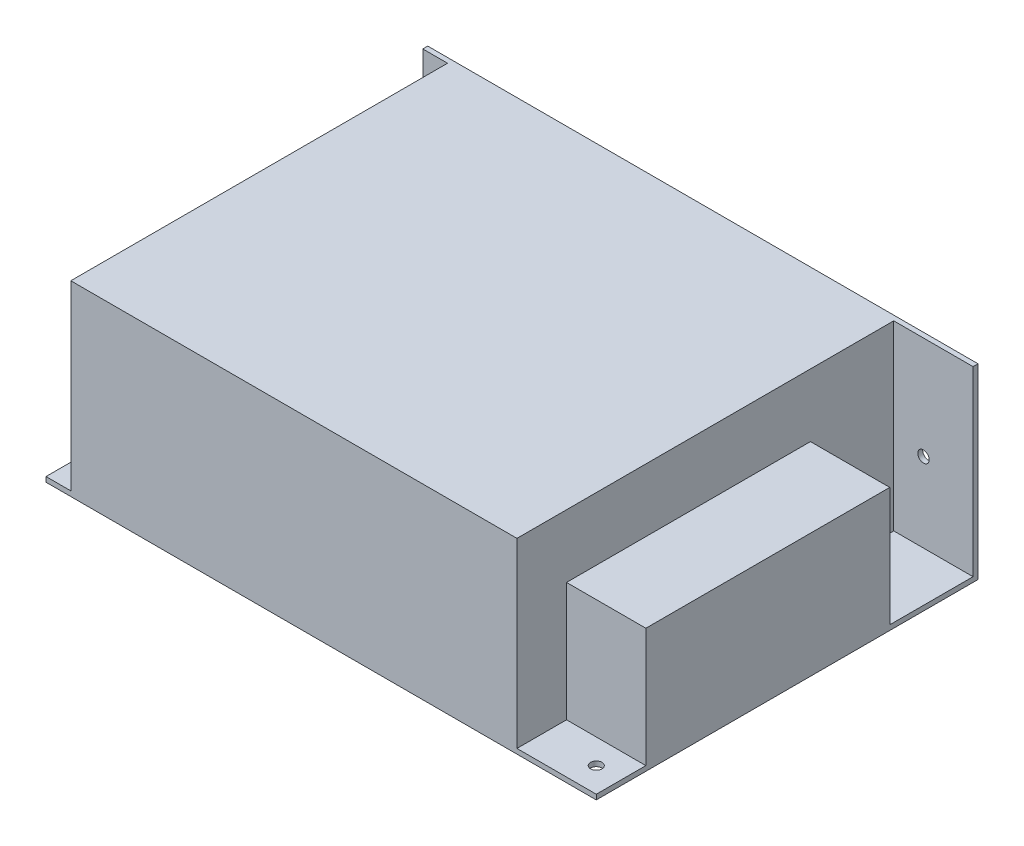
ISO-10303-21;
HEADER;
FILE_DESCRIPTION(('STEP AP214'),'2;1');
FILE_NAME('part.step','',(''),(''),'','','');
FILE_SCHEMA(('AUTOMOTIVE_DESIGN { 1 0 10303 214 1 1 1 1 }'));
ENDSEC;
DATA;
#1=APPLICATION_CONTEXT('core data for automotive mechanical design processes');
#2=APPLICATION_PROTOCOL_DEFINITION('international standard','automotive_design',2000,#1);
#3=PRODUCT_CONTEXT('',#1,'mechanical');
#4=PRODUCT('Part','Part','',(#3));
#5=PRODUCT_RELATED_PRODUCT_CATEGORY('part','',(#4));
#6=PRODUCT_DEFINITION_FORMATION('','',#4);
#7=PRODUCT_DEFINITION_CONTEXT('part definition',#1,'design');
#8=PRODUCT_DEFINITION('design','',#6,#7);
#9=PRODUCT_DEFINITION_SHAPE('','',#8);
#10=(LENGTH_UNIT() NAMED_UNIT(*) SI_UNIT(.MILLI.,.METRE.));
#11=(NAMED_UNIT(*) PLANE_ANGLE_UNIT() SI_UNIT($,.RADIAN.));
#12=(NAMED_UNIT(*) SI_UNIT($,.STERADIAN.) SOLID_ANGLE_UNIT());
#13=UNCERTAINTY_MEASURE_WITH_UNIT(LENGTH_MEASURE(1.E-05),#10,'distance_accuracy_value','');
#14=(GEOMETRIC_REPRESENTATION_CONTEXT(3) GLOBAL_UNCERTAINTY_ASSIGNED_CONTEXT((#13)) GLOBAL_UNIT_ASSIGNED_CONTEXT((#10,
#11,#12)) REPRESENTATION_CONTEXT('',''));
#15=CARTESIAN_POINT('',(0.,0.,0.));
#16=DIRECTION('',(0.,0.,1.));
#17=DIRECTION('',(1.,0.,0.));
#18=AXIS2_PLACEMENT_3D('',#15,#16,#17);
#19=CARTESIAN_POINT('',(-55.5,1.,38.5));
#20=DIRECTION('',(1.,0.,0.));
#21=DIRECTION('',(0.,0.,-1.));
#22=AXIS2_PLACEMENT_3D('',#19,#20,#21);
#23=PLANE('',#22);
#24=DIRECTION('',(0.,-1.,0.));
#25=VECTOR('',#24,1.);
#26=CARTESIAN_POINT('',(-55.5,37.7,-37.5));
#27=LINE('',#26,#25);
#28=CARTESIAN_POINT('',(-55.5,27.4065158912773,-37.5));
#29=VERTEX_POINT('',#28);
#30=CARTESIAN_POINT('',(-55.5,1.,-37.5));
#31=VERTEX_POINT('',#30);
#32=EDGE_CURVE('E269',#29,#31,#27,.T.);
#33=ORIENTED_EDGE('',*,*,#32,.F.);
#34=DIRECTION('',(0.,0.,-1.));
#35=VECTOR('',#34,1.);
#36=CARTESIAN_POINT('',(-55.5,27.4065158912773,-33.5));
#37=LINE('',#36,#35);
#38=CARTESIAN_POINT('',(-55.5,27.4065158912773,-38.5));
#39=VERTEX_POINT('',#38);
#40=EDGE_CURVE('E183',#29,#39,#37,.T.);
#41=ORIENTED_EDGE('',*,*,#40,.T.);
#42=DIRECTION('',(0.,-1.,0.));
#43=VECTOR('',#42,1.);
#44=CARTESIAN_POINT('',(-55.5,1.,-38.5));
#45=LINE('',#44,#43);
#46=CARTESIAN_POINT('',(-55.5,0.,-38.5));
#47=VERTEX_POINT('',#46);
#48=EDGE_CURVE('E284',#39,#47,#45,.T.);
#49=ORIENTED_EDGE('',*,*,#48,.T.);
#50=DIRECTION('',(0.,0.,1.));
#51=VECTOR('',#50,1.);
#52=CARTESIAN_POINT('',(-55.5,0.,38.5));
#53=LINE('',#52,#51);
#54=CARTESIAN_POINT('',(-55.5,0.,38.5));
#55=VERTEX_POINT('',#54);
#56=EDGE_CURVE('E273',#47,#55,#53,.T.);
#57=ORIENTED_EDGE('',*,*,#56,.T.);
#58=DIRECTION('',(0.,-1.,0.));
#59=VECTOR('',#58,1.);
#60=CARTESIAN_POINT('',(-55.5,1.,38.5));
#61=LINE('',#60,#59);
#62=CARTESIAN_POINT('',(-55.5,1.,38.5));
#63=VERTEX_POINT('',#62);
#64=EDGE_CURVE('E11',#63,#55,#61,.T.);
#65=ORIENTED_EDGE('',*,*,#64,.F.);
#66=DIRECTION('',(0.,0.,1.));
#67=VECTOR('',#66,1.);
#68=CARTESIAN_POINT('',(-55.5,1.,38.5));
#69=LINE('',#68,#67);
#70=EDGE_CURVE('E274',#31,#63,#69,.T.);
#71=ORIENTED_EDGE('',*,*,#70,.F.);
#72=EDGE_LOOP('',(#33,#41,#49,#57,#65,#71));
#73=FACE_BOUND('',#72,.T.);
#74=ADVANCED_FACE('F32',(#73),#23,.F.);
#75=CARTESIAN_POINT('',(0.,1.,0.));
#76=DIRECTION('',(0.,1.,0.));
#77=DIRECTION('',(0.,0.,1.));
#78=AXIS2_PLACEMENT_3D('',#75,#76,#77);
#79=PLANE('',#78);
#80=DIRECTION('',(0.,0.,-1.));
#81=VECTOR('',#80,1.);
#82=CARTESIAN_POINT('',(39.5,1.,-37.5));
#83=LINE('',#82,#81);
#84=CARTESIAN_POINT('',(39.5,1.,-20.7));
#85=VERTEX_POINT('',#84);
#86=CARTESIAN_POINT('',(39.5,1.,-37.5));
#87=VERTEX_POINT('',#86);
#88=EDGE_CURVE('E238',#85,#87,#83,.T.);
#89=ORIENTED_EDGE('',*,*,#88,.F.);
#90=DIRECTION('',(-1.,0.,0.));
#91=VECTOR('',#90,1.);
#92=CARTESIAN_POINT('',(55.5,1.,-20.7));
#93=LINE('',#92,#91);
#94=CARTESIAN_POINT('',(55.5,1.,-20.7));
#95=VERTEX_POINT('',#94);
#96=EDGE_CURVE('E55',#95,#85,#93,.T.);
#97=ORIENTED_EDGE('',*,*,#96,.F.);
#98=DIRECTION('',(0.,0.,-1.));
#99=VECTOR('',#98,1.);
#100=CARTESIAN_POINT('',(55.5,1.,38.5));
#101=LINE('',#100,#99);
#102=CARTESIAN_POINT('',(55.5,1.,-37.5));
#103=VERTEX_POINT('',#102);
#104=EDGE_CURVE('E281',#95,#103,#101,.T.);
#105=ORIENTED_EDGE('',*,*,#104,.T.);
#106=DIRECTION('',(1.,0.,0.));
#107=VECTOR('',#106,1.);
#108=CARTESIAN_POINT('',(-55.5,1.,-37.5));
#109=LINE('',#108,#107);
#110=EDGE_CURVE('E249',#87,#103,#109,.T.);
#111=ORIENTED_EDGE('',*,*,#110,.F.);
#112=EDGE_LOOP('',(#89,#97,#105,#111));
#113=FACE_BOUND('',#112,.T.);
#114=ADVANCED_FACE('F366',(#113),#79,.T.);
#115=CARTESIAN_POINT('',(50.5,1.,33.5));
#116=DIRECTION('',(0.,1.,0.));
#117=DIRECTION('',(0.,0.,1.));
#118=AXIS2_PLACEMENT_3D('',#115,#116,#117);
#119=CIRCLE('',#118,1.15);
#120=CARTESIAN_POINT('',(50.5,1.,34.65));
#121=VERTEX_POINT('',#120);
#122=EDGE_CURVE('E174',#121,#121,#119,.T.);
#123=ORIENTED_EDGE('',*,*,#122,.F.);
#124=EDGE_LOOP('',(#123));
#125=FACE_BOUND('',#124,.T.);
#126=CARTESIAN_POINT('',(55.5,1.,38.5));
#127=VERTEX_POINT('',#126);
#128=CARTESIAN_POINT('',(55.5,1.,28.5));
#129=VERTEX_POINT('',#128);
#130=EDGE_CURVE('E282',#127,#129,#101,.T.);
#131=ORIENTED_EDGE('',*,*,#130,.T.);
#132=DIRECTION('',(1.,0.,0.));
#133=VECTOR('',#132,1.);
#134=CARTESIAN_POINT('',(55.5,1.,28.5));
#135=LINE('',#134,#133);
#136=CARTESIAN_POINT('',(39.5,1.,28.5));
#137=VERTEX_POINT('',#136);
#138=EDGE_CURVE('E203',#137,#129,#135,.T.);
#139=ORIENTED_EDGE('',*,*,#138,.F.);
#140=CARTESIAN_POINT('',(39.5,1.,38.5));
#141=VERTEX_POINT('',#140);
#142=EDGE_CURVE('E230',#141,#137,#83,.T.);
#143=ORIENTED_EDGE('',*,*,#142,.F.);
#144=DIRECTION('',(1.,0.,0.));
#145=VECTOR('',#144,1.);
#146=CARTESIAN_POINT('',(55.5,1.,38.5));
#147=LINE('',#146,#145);
#148=EDGE_CURVE('E276',#141,#127,#147,.T.);
#149=ORIENTED_EDGE('',*,*,#148,.T.);
#150=EDGE_LOOP('',(#131,#139,#143,#149));
#151=FACE_BOUND('',#150,.T.);
#152=ADVANCED_FACE('F334',(#125,#151),#79,.T.);
#153=CARTESIAN_POINT('',(39.5,37.7,-37.5));
#154=DIRECTION('',(-1.,0.,0.));
#155=DIRECTION('',(0.,0.,1.));
#156=AXIS2_PLACEMENT_3D('',#153,#154,#155);
#157=PLANE('',#156);
#158=DIRECTION('',(0.,-1.,0.));
#159=VECTOR('',#158,1.);
#160=CARTESIAN_POINT('',(39.5,25.,-20.7));
#161=LINE('',#160,#159);
#162=CARTESIAN_POINT('',(39.5,25.,-20.7));
#163=VERTEX_POINT('',#162);
#164=EDGE_CURVE('E220',#163,#85,#161,.T.);
#165=ORIENTED_EDGE('',*,*,#164,.T.);
#166=ORIENTED_EDGE('',*,*,#88,.T.);
#167=DIRECTION('',(0.,-1.,0.));
#168=VECTOR('',#167,1.);
#169=CARTESIAN_POINT('',(39.5,37.7,-37.5));
#170=LINE('',#169,#168);
#171=CARTESIAN_POINT('',(39.5,37.7,-37.5));
#172=VERTEX_POINT('',#171);
#173=EDGE_CURVE('E242',#172,#87,#170,.T.);
#174=ORIENTED_EDGE('',*,*,#173,.F.);
#175=DIRECTION('',(0.,0.,-1.));
#176=VECTOR('',#175,1.);
#177=CARTESIAN_POINT('',(39.5,37.7,-37.5));
#178=LINE('',#177,#176);
#179=CARTESIAN_POINT('',(39.5,37.7,38.5));
#180=VERTEX_POINT('',#179);
#181=EDGE_CURVE('E232',#180,#172,#178,.T.);
#182=ORIENTED_EDGE('',*,*,#181,.F.);
#183=DIRECTION('',(0.,-1.,0.));
#184=VECTOR('',#183,1.);
#185=CARTESIAN_POINT('',(39.5,37.7,38.5));
#186=LINE('',#185,#184);
#187=EDGE_CURVE('E245',#180,#141,#186,.T.);
#188=ORIENTED_EDGE('',*,*,#187,.T.);
#189=ORIENTED_EDGE('',*,*,#142,.T.);
#190=DIRECTION('',(0.,-1.,0.));
#191=VECTOR('',#190,1.);
#192=CARTESIAN_POINT('',(39.5,25.,28.5));
#193=LINE('',#192,#191);
#194=CARTESIAN_POINT('',(39.5,25.,28.5));
#195=VERTEX_POINT('',#194);
#196=EDGE_CURVE('E217',#195,#137,#193,.T.);
#197=ORIENTED_EDGE('',*,*,#196,.F.);
#198=DIRECTION('',(0.,0.,1.));
#199=VECTOR('',#198,1.);
#200=CARTESIAN_POINT('',(39.5,25.,-20.7));
#201=LINE('',#200,#199);
#202=EDGE_CURVE('E206',#163,#195,#201,.T.);
#203=ORIENTED_EDGE('',*,*,#202,.F.);
#204=EDGE_LOOP('',(#165,#166,#174,#182,#188,#189,#197,#203));
#205=FACE_BOUND('',#204,.T.);
#206=ADVANCED_FACE('F336',(#205),#157,.F.);
#207=CARTESIAN_POINT('',(-50.5,1.,38.5));
#208=VERTEX_POINT('',#207);
#209=EDGE_CURVE('E278',#63,#208,#147,.T.);
#210=ORIENTED_EDGE('',*,*,#209,.T.);
#211=DIRECTION('',(0.,0.,1.));
#212=VECTOR('',#211,1.);
#213=CARTESIAN_POINT('',(-50.5,1.,-37.5));
#214=LINE('',#213,#212);
#215=CARTESIAN_POINT('',(-50.5,1.,-37.5));
#216=VERTEX_POINT('',#215);
#217=EDGE_CURVE('E225',#216,#208,#214,.T.);
#218=ORIENTED_EDGE('',*,*,#217,.F.);
#219=EDGE_CURVE('E254',#31,#216,#109,.T.);
#220=ORIENTED_EDGE('',*,*,#219,.F.);
#221=ORIENTED_EDGE('',*,*,#70,.T.);
#222=EDGE_LOOP('',(#210,#218,#220,#221));
#223=FACE_BOUND('',#222,.T.);
#224=ADVANCED_FACE('F347',(#223),#79,.T.);
#225=CARTESIAN_POINT('',(-55.5,37.7,-37.5));
#226=DIRECTION('',(0.,0.,-1.));
#227=DIRECTION('',(-1.,0.,0.));
#228=AXIS2_PLACEMENT_3D('',#225,#226,#227);
#229=PLANE('',#228);
#230=CARTESIAN_POINT('',(-52.6,29.0065158912773,-37.5));
#231=DIRECTION('',(0.,0.,-1.));
#232=DIRECTION('',(-1.,0.,0.));
#233=AXIS2_PLACEMENT_3D('',#230,#231,#232);
#234=CIRCLE('',#233,1.6);
#235=CARTESIAN_POINT('',(-52.6,30.6065158912773,-37.5));
#236=VERTEX_POINT('',#235);
#237=CARTESIAN_POINT('',(-52.6,27.4065158912773,-37.5));
#238=VERTEX_POINT('',#237);
#239=EDGE_CURVE('E166',#236,#238,#234,.T.);
#240=ORIENTED_EDGE('',*,*,#239,.T.);
#241=DIRECTION('',(-1.,0.,0.));
#242=VECTOR('',#241,1.);
#243=CARTESIAN_POINT('',(-55.5,27.4065158912773,-37.5));
#244=LINE('',#243,#242);
#245=EDGE_CURVE('E193',#238,#29,#244,.T.);
#246=ORIENTED_EDGE('',*,*,#245,.T.);
#247=ORIENTED_EDGE('',*,*,#32,.T.);
#248=ORIENTED_EDGE('',*,*,#219,.T.);
#249=DIRECTION('',(0.,-1.,0.));
#250=VECTOR('',#249,1.);
#251=CARTESIAN_POINT('',(-50.5,37.7,-37.5));
#252=LINE('',#251,#250);
#253=CARTESIAN_POINT('',(-50.5,37.7,-37.5));
#254=VERTEX_POINT('',#253);
#255=EDGE_CURVE('E235',#254,#216,#252,.T.);
#256=ORIENTED_EDGE('',*,*,#255,.F.);
#257=DIRECTION('',(1.,0.,0.));
#258=VECTOR('',#257,1.);
#259=CARTESIAN_POINT('',(-55.5,37.7,-37.5));
#260=LINE('',#259,#258);
#261=CARTESIAN_POINT('',(-55.5,37.7,-37.5));
#262=VERTEX_POINT('',#261);
#263=EDGE_CURVE('E255',#262,#254,#260,.T.);
#264=ORIENTED_EDGE('',*,*,#263,.F.);
#265=CARTESIAN_POINT('',(-55.5,30.6065158912773,-37.5));
#266=VERTEX_POINT('',#265);
#267=EDGE_CURVE('E270',#262,#266,#27,.T.);
#268=ORIENTED_EDGE('',*,*,#267,.T.);
#269=DIRECTION('',(1.,0.,0.));
#270=VECTOR('',#269,1.);
#271=CARTESIAN_POINT('',(-55.5,30.6065158912773,-37.5));
#272=LINE('',#271,#270);
#273=EDGE_CURVE('E189',#266,#236,#272,.T.);
#274=ORIENTED_EDGE('',*,*,#273,.T.);
#275=EDGE_LOOP('',(#240,#246,#247,#248,#256,#264,#268,#274));
#276=FACE_BOUND('',#275,.T.);
#277=ADVANCED_FACE('F355',(#276),#229,.F.);
#278=CARTESIAN_POINT('',(45.5,17.,-37.5));
#279=DIRECTION('',(0.,0.,-1.));
#280=DIRECTION('',(-1.,0.,0.));
#281=AXIS2_PLACEMENT_3D('',#278,#279,#280);
#282=CIRCLE('',#281,1.15);
#283=CARTESIAN_POINT('',(44.35,17.,-37.5));
#284=VERTEX_POINT('',#283);
#285=EDGE_CURVE('E196',#284,#284,#282,.T.);
#286=ORIENTED_EDGE('',*,*,#285,.T.);
#287=EDGE_LOOP('',(#286));
#288=FACE_BOUND('',#287,.T.);
#289=ORIENTED_EDGE('',*,*,#173,.T.);
#290=ORIENTED_EDGE('',*,*,#110,.T.);
#291=DIRECTION('',(0.,-1.,0.));
#292=VECTOR('',#291,1.);
#293=CARTESIAN_POINT('',(55.5,37.7,-37.5));
#294=LINE('',#293,#292);
#295=CARTESIAN_POINT('',(55.5,37.7,-37.5));
#296=VERTEX_POINT('',#295);
#297=EDGE_CURVE('E264',#296,#103,#294,.T.);
#298=ORIENTED_EDGE('',*,*,#297,.F.);
#299=EDGE_CURVE('E253',#172,#296,#260,.T.);
#300=ORIENTED_EDGE('',*,*,#299,.F.);
#301=EDGE_LOOP('',(#289,#290,#298,#300));
#302=FACE_BOUND('',#301,.T.);
#303=ADVANCED_FACE('F319',(#288,#302),#229,.F.);
#304=CARTESIAN_POINT('',(-55.5,37.7,-38.5));
#305=VERTEX_POINT('',#304);
#306=CARTESIAN_POINT('',(-55.5,30.6065158912773,-38.5));
#307=VERTEX_POINT('',#306);
#308=EDGE_CURVE('E293',#305,#307,#45,.T.);
#309=ORIENTED_EDGE('',*,*,#308,.T.);
#310=DIRECTION('',(0.,0.,-1.));
#311=VECTOR('',#310,1.);
#312=CARTESIAN_POINT('',(-55.5,30.6065158912773,-33.5));
#313=LINE('',#312,#311);
#314=EDGE_CURVE('E47',#266,#307,#313,.T.);
#315=ORIENTED_EDGE('',*,*,#314,.F.);
#316=ORIENTED_EDGE('',*,*,#267,.F.);
#317=DIRECTION('',(0.,0.,1.));
#318=VECTOR('',#317,1.);
#319=CARTESIAN_POINT('',(-55.5,37.7,-38.5));
#320=LINE('',#319,#318);
#321=EDGE_CURVE('E250',#305,#262,#320,.T.);
#322=ORIENTED_EDGE('',*,*,#321,.F.);
#323=EDGE_LOOP('',(#309,#315,#316,#322));
#324=FACE_BOUND('',#323,.T.);
#325=ADVANCED_FACE('F34',(#324),#23,.F.);
#326=CARTESIAN_POINT('',(55.5,1.,38.5));
#327=DIRECTION('',(0.,0.,-1.));
#328=DIRECTION('',(-1.,0.,0.));
#329=AXIS2_PLACEMENT_3D('',#326,#327,#328);
#330=PLANE('',#329);
#331=DIRECTION('',(1.,0.,0.));
#332=VECTOR('',#331,1.);
#333=CARTESIAN_POINT('',(55.5,0.,38.5));
#334=LINE('',#333,#332);
#335=CARTESIAN_POINT('',(55.5,0.,38.5));
#336=VERTEX_POINT('',#335);
#337=EDGE_CURVE('E287',#55,#336,#334,.T.);
#338=ORIENTED_EDGE('',*,*,#337,.T.);
#339=DIRECTION('',(0.,-1.,0.));
#340=VECTOR('',#339,1.);
#341=CARTESIAN_POINT('',(55.5,1.,38.5));
#342=LINE('',#341,#340);
#343=EDGE_CURVE('E40',#127,#336,#342,.T.);
#344=ORIENTED_EDGE('',*,*,#343,.F.);
#345=ORIENTED_EDGE('',*,*,#148,.F.);
#346=ORIENTED_EDGE('',*,*,#187,.F.);
#347=DIRECTION('',(1.,0.,0.));
#348=VECTOR('',#347,1.);
#349=CARTESIAN_POINT('',(-50.5,37.7,38.5));
#350=LINE('',#349,#348);
#351=CARTESIAN_POINT('',(-50.5,37.7,38.5));
#352=VERTEX_POINT('',#351);
#353=EDGE_CURVE('E229',#352,#180,#350,.T.);
#354=ORIENTED_EDGE('',*,*,#353,.F.);
#355=DIRECTION('',(0.,-1.,0.));
#356=VECTOR('',#355,1.);
#357=CARTESIAN_POINT('',(-50.5,37.7,38.5));
#358=LINE('',#357,#356);
#359=EDGE_CURVE('E247',#352,#208,#358,.T.);
#360=ORIENTED_EDGE('',*,*,#359,.T.);
#361=ORIENTED_EDGE('',*,*,#209,.F.);
#362=ORIENTED_EDGE('',*,*,#64,.T.);
#363=EDGE_LOOP('',(#338,#344,#345,#346,#354,#360,#361,#362));
#364=FACE_BOUND('',#363,.T.);
#365=ADVANCED_FACE('F338',(#364),#330,.F.);
#366=CARTESIAN_POINT('',(55.5,1.,38.5));
#367=DIRECTION('',(-1.,0.,0.));
#368=DIRECTION('',(0.,0.,1.));
#369=AXIS2_PLACEMENT_3D('',#366,#367,#368);
#370=PLANE('',#369);
#371=DIRECTION('',(0.,0.,-1.));
#372=VECTOR('',#371,1.);
#373=CARTESIAN_POINT('',(55.5,0.,38.5));
#374=LINE('',#373,#372);
#375=CARTESIAN_POINT('',(55.5,0.,-38.5));
#376=VERTEX_POINT('',#375);
#377=EDGE_CURVE('E289',#336,#376,#374,.T.);
#378=ORIENTED_EDGE('',*,*,#377,.T.);
#379=DIRECTION('',(0.,-1.,0.));
#380=VECTOR('',#379,1.);
#381=CARTESIAN_POINT('',(55.5,1.,-38.5));
#382=LINE('',#381,#380);
#383=CARTESIAN_POINT('',(55.5,37.7,-38.5));
#384=VERTEX_POINT('',#383);
#385=EDGE_CURVE('E295',#384,#376,#382,.T.);
#386=ORIENTED_EDGE('',*,*,#385,.F.);
#387=DIRECTION('',(0.,0.,-1.));
#388=VECTOR('',#387,1.);
#389=CARTESIAN_POINT('',(55.5,37.7,-38.5));
#390=LINE('',#389,#388);
#391=EDGE_CURVE('E258',#296,#384,#390,.T.);
#392=ORIENTED_EDGE('',*,*,#391,.F.);
#393=ORIENTED_EDGE('',*,*,#297,.T.);
#394=ORIENTED_EDGE('',*,*,#104,.F.);
#395=DIRECTION('',(0.,-1.,0.));
#396=VECTOR('',#395,1.);
#397=CARTESIAN_POINT('',(55.5,25.,-20.7));
#398=LINE('',#397,#396);
#399=CARTESIAN_POINT('',(55.5,25.,-20.7));
#400=VERTEX_POINT('',#399);
#401=EDGE_CURVE('E222',#400,#95,#398,.T.);
#402=ORIENTED_EDGE('',*,*,#401,.F.);
#403=DIRECTION('',(0.,0.,-1.));
#404=VECTOR('',#403,1.);
#405=CARTESIAN_POINT('',(55.5,25.,-20.7));
#406=LINE('',#405,#404);
#407=CARTESIAN_POINT('',(55.5,25.,28.5));
#408=VERTEX_POINT('',#407);
#409=EDGE_CURVE('E199',#408,#400,#406,.T.);
#410=ORIENTED_EDGE('',*,*,#409,.F.);
#411=DIRECTION('',(0.,-1.,0.));
#412=VECTOR('',#411,1.);
#413=CARTESIAN_POINT('',(55.5,25.,28.5));
#414=LINE('',#413,#412);
#415=EDGE_CURVE('E211',#408,#129,#414,.T.);
#416=ORIENTED_EDGE('',*,*,#415,.T.);
#417=ORIENTED_EDGE('',*,*,#130,.F.);
#418=ORIENTED_EDGE('',*,*,#343,.T.);
#419=EDGE_LOOP('',(#378,#386,#392,#393,#394,#402,#410,#416,#417,#418));
#420=FACE_BOUND('',#419,.T.);
#421=ADVANCED_FACE('F302',(#420),#370,.F.);
#422=CARTESIAN_POINT('',(55.5,1.,-38.5));
#423=DIRECTION('',(0.,0.,1.));
#424=DIRECTION('',(1.,0.,0.));
#425=AXIS2_PLACEMENT_3D('',#422,#423,#424);
#426=PLANE('',#425);
#427=CARTESIAN_POINT('',(45.5,17.,-38.5));
#428=DIRECTION('',(0.,0.,-1.));
#429=DIRECTION('',(-1.,0.,0.));
#430=AXIS2_PLACEMENT_3D('',#427,#428,#429);
#431=CIRCLE('',#430,1.15);
#432=CARTESIAN_POINT('',(44.35,17.,-38.5));
#433=VERTEX_POINT('',#432);
#434=EDGE_CURVE('E191',#433,#433,#431,.T.);
#435=ORIENTED_EDGE('',*,*,#434,.F.);
#436=EDGE_LOOP('',(#435));
#437=FACE_BOUND('',#436,.T.);
#438=CARTESIAN_POINT('',(-43.5,13.,-38.5));
#439=DIRECTION('',(0.,0.,-1.));
#440=DIRECTION('',(-1.,0.,0.));
#441=AXIS2_PLACEMENT_3D('',#438,#439,#440);
#442=CIRCLE('',#441,1.15);
#443=CARTESIAN_POINT('',(-44.65,13.,-38.5));
#444=VERTEX_POINT('',#443);
#445=EDGE_CURVE('E186',#444,#444,#442,.T.);
#446=ORIENTED_EDGE('',*,*,#445,.F.);
#447=EDGE_LOOP('',(#446));
#448=FACE_BOUND('',#447,.T.);
#449=ORIENTED_EDGE('',*,*,#48,.F.);
#450=DIRECTION('',(-1.,0.,0.));
#451=VECTOR('',#450,1.);
#452=CARTESIAN_POINT('',(-55.5,27.4065158912773,-38.5));
#453=LINE('',#452,#451);
#454=CARTESIAN_POINT('',(-52.6,27.4065158912773,-38.5));
#455=VERTEX_POINT('',#454);
#456=EDGE_CURVE('E178',#455,#39,#453,.T.);
#457=ORIENTED_EDGE('',*,*,#456,.F.);
#458=CARTESIAN_POINT('',(-52.6,29.0065158912773,-38.5));
#459=DIRECTION('',(0.,0.,-1.));
#460=DIRECTION('',(-1.,0.,0.));
#461=AXIS2_PLACEMENT_3D('',#458,#459,#460);
#462=CIRCLE('',#461,1.6);
#463=CARTESIAN_POINT('',(-52.6,30.6065158912773,-38.5));
#464=VERTEX_POINT('',#463);
#465=EDGE_CURVE('E163',#464,#455,#462,.T.);
#466=ORIENTED_EDGE('',*,*,#465,.F.);
#467=DIRECTION('',(1.,0.,0.));
#468=VECTOR('',#467,1.);
#469=CARTESIAN_POINT('',(-55.5,30.6065158912773,-38.5));
#470=LINE('',#469,#468);
#471=EDGE_CURVE('E170',#307,#464,#470,.T.);
#472=ORIENTED_EDGE('',*,*,#471,.F.);
#473=ORIENTED_EDGE('',*,*,#308,.F.);
#474=DIRECTION('',(-1.,0.,0.));
#475=VECTOR('',#474,1.);
#476=CARTESIAN_POINT('',(-55.5,37.7,-38.5));
#477=LINE('',#476,#475);
#478=EDGE_CURVE('E261',#384,#305,#477,.T.);
#479=ORIENTED_EDGE('',*,*,#478,.F.);
#480=ORIENTED_EDGE('',*,*,#385,.T.);
#481=DIRECTION('',(-1.,0.,0.));
#482=VECTOR('',#481,1.);
#483=CARTESIAN_POINT('',(55.5,0.,-38.5));
#484=LINE('',#483,#482);
#485=EDGE_CURVE('E277',#376,#47,#484,.T.);
#486=ORIENTED_EDGE('',*,*,#485,.T.);
#487=EDGE_LOOP('',(#449,#457,#466,#472,#473,#479,#480,#486));
#488=FACE_BOUND('',#487,.T.);
#489=ADVANCED_FACE('F177',(#437,#448,#488),#426,.F.);
#490=CARTESIAN_POINT('',(0.,0.,0.));
#491=DIRECTION('',(0.,1.,0.));
#492=DIRECTION('',(0.,0.,1.));
#493=AXIS2_PLACEMENT_3D('',#490,#491,#492);
#494=PLANE('',#493);
#495=CARTESIAN_POINT('',(-42.5,0.,31.5));
#496=DIRECTION('',(0.,-1.,0.));
#497=DIRECTION('',(0.,0.,-1.));
#498=AXIS2_PLACEMENT_3D('',#495,#496,#497);
#499=CIRCLE('',#498,1.15);
#500=CARTESIAN_POINT('',(-42.5,0.,30.35));
#501=VERTEX_POINT('',#500);
#502=EDGE_CURVE('E663',#501,#501,#499,.T.);
#503=ORIENTED_EDGE('',*,*,#502,.F.);
#504=EDGE_LOOP('',(#503));
#505=FACE_BOUND('',#504,.T.);
#506=CARTESIAN_POINT('',(-13.,0.,-15.));
#507=DIRECTION('',(0.,-1.,0.));
#508=DIRECTION('',(0.,0.,-1.));
#509=AXIS2_PLACEMENT_3D('',#506,#507,#508);
#510=CIRCLE('',#509,1.15);
#511=CARTESIAN_POINT('',(-13.,0.,-16.15));
#512=VERTEX_POINT('',#511);
#513=EDGE_CURVE('E681',#512,#512,#510,.T.);
#514=ORIENTED_EDGE('',*,*,#513,.F.);
#515=EDGE_LOOP('',(#514));
#516=FACE_BOUND('',#515,.T.);
#517=CARTESIAN_POINT('',(23.5,0.,13.5));
#518=DIRECTION('',(0.,-1.,0.));
#519=DIRECTION('',(0.,0.,-1.));
#520=AXIS2_PLACEMENT_3D('',#517,#518,#519);
#521=CIRCLE('',#520,1.15);
#522=CARTESIAN_POINT('',(23.5,0.,12.35));
#523=VERTEX_POINT('',#522);
#524=EDGE_CURVE('E675',#523,#523,#521,.T.);
#525=ORIENTED_EDGE('',*,*,#524,.F.);
#526=EDGE_LOOP('',(#525));
#527=FACE_BOUND('',#526,.T.);
#528=CARTESIAN_POINT('',(-13.,0.,13.));
#529=DIRECTION('',(0.,-1.,0.));
#530=DIRECTION('',(0.,0.,-1.));
#531=AXIS2_PLACEMENT_3D('',#528,#529,#530);
#532=CIRCLE('',#531,1.15);
#533=CARTESIAN_POINT('',(-13.,0.,11.85));
#534=VERTEX_POINT('',#533);
#535=EDGE_CURVE('E674',#534,#534,#532,.T.);
#536=ORIENTED_EDGE('',*,*,#535,.F.);
#537=EDGE_LOOP('',(#536));
#538=FACE_BOUND('',#537,.T.);
#539=CARTESIAN_POINT('',(50.5,0.,33.5));
#540=DIRECTION('',(0.,-1.,0.));
#541=DIRECTION('',(0.,0.,-1.));
#542=AXIS2_PLACEMENT_3D('',#539,#540,#541);
#543=CIRCLE('',#542,1.15);
#544=CARTESIAN_POINT('',(50.5,0.,32.35));
#545=VERTEX_POINT('',#544);
#546=EDGE_CURVE('E668',#545,#545,#543,.T.);
#547=ORIENTED_EDGE('',*,*,#546,.F.);
#548=EDGE_LOOP('',(#547));
#549=FACE_BOUND('',#548,.T.);
#550=ORIENTED_EDGE('',*,*,#56,.F.);
#551=ORIENTED_EDGE('',*,*,#485,.F.);
#552=ORIENTED_EDGE('',*,*,#377,.F.);
#553=ORIENTED_EDGE('',*,*,#337,.F.);
#554=EDGE_LOOP('',(#550,#551,#552,#553));
#555=FACE_BOUND('',#554,.T.);
#556=ADVANCED_FACE('F308',(#505,#516,#527,#538,#549,#555),#494,.F.);
#557=CARTESIAN_POINT('',(0.,37.7,0.));
#558=DIRECTION('',(0.,1.,0.));
#559=DIRECTION('',(0.,0.,1.));
#560=AXIS2_PLACEMENT_3D('',#557,#558,#559);
#561=PLANE('',#560);
#562=ORIENTED_EDGE('',*,*,#321,.T.);
#563=ORIENTED_EDGE('',*,*,#263,.T.);
#564=DIRECTION('',(0.,0.,1.));
#565=VECTOR('',#564,1.);
#566=CARTESIAN_POINT('',(-50.5,37.7,-37.5));
#567=LINE('',#566,#565);
#568=EDGE_CURVE('E226',#254,#352,#567,.T.);
#569=ORIENTED_EDGE('',*,*,#568,.T.);
#570=ORIENTED_EDGE('',*,*,#353,.T.);
#571=ORIENTED_EDGE('',*,*,#181,.T.);
#572=ORIENTED_EDGE('',*,*,#299,.T.);
#573=ORIENTED_EDGE('',*,*,#391,.T.);
#574=ORIENTED_EDGE('',*,*,#478,.T.);
#575=EDGE_LOOP('',(#562,#563,#569,#570,#571,#572,#573,#574));
#576=FACE_BOUND('',#575,.T.);
#577=ADVANCED_FACE('F312',(#576),#561,.T.);
#578=CARTESIAN_POINT('',(-50.5,37.7,-37.5));
#579=DIRECTION('',(1.,0.,0.));
#580=DIRECTION('',(0.,0.,-1.));
#581=AXIS2_PLACEMENT_3D('',#578,#579,#580);
#582=PLANE('',#581);
#583=ORIENTED_EDGE('',*,*,#217,.T.);
#584=ORIENTED_EDGE('',*,*,#359,.F.);
#585=ORIENTED_EDGE('',*,*,#568,.F.);
#586=ORIENTED_EDGE('',*,*,#255,.T.);
#587=EDGE_LOOP('',(#583,#584,#585,#586));
#588=FACE_BOUND('',#587,.T.);
#589=ADVANCED_FACE('F343',(#588),#582,.F.);
#590=CARTESIAN_POINT('',(55.5,25.,-20.7));
#591=DIRECTION('',(0.,0.,1.));
#592=DIRECTION('',(1.,0.,0.));
#593=AXIS2_PLACEMENT_3D('',#590,#591,#592);
#594=PLANE('',#593);
#595=ORIENTED_EDGE('',*,*,#96,.T.);
#596=ORIENTED_EDGE('',*,*,#164,.F.);
#597=DIRECTION('',(-1.,0.,0.));
#598=VECTOR('',#597,1.);
#599=CARTESIAN_POINT('',(55.5,25.,-20.7));
#600=LINE('',#599,#598);
#601=EDGE_CURVE('E202',#400,#163,#600,.T.);
#602=ORIENTED_EDGE('',*,*,#601,.F.);
#603=ORIENTED_EDGE('',*,*,#401,.T.);
#604=EDGE_LOOP('',(#595,#596,#602,#603));
#605=FACE_BOUND('',#604,.T.);
#606=ADVANCED_FACE('F324',(#605),#594,.F.);
#607=CARTESIAN_POINT('',(55.5,25.,28.5));
#608=DIRECTION('',(0.,0.,-1.));
#609=DIRECTION('',(-1.,0.,0.));
#610=AXIS2_PLACEMENT_3D('',#607,#608,#609);
#611=PLANE('',#610);
#612=ORIENTED_EDGE('',*,*,#138,.T.);
#613=ORIENTED_EDGE('',*,*,#415,.F.);
#614=DIRECTION('',(1.,0.,0.));
#615=VECTOR('',#614,1.);
#616=CARTESIAN_POINT('',(55.5,25.,28.5));
#617=LINE('',#616,#615);
#618=EDGE_CURVE('E209',#195,#408,#617,.T.);
#619=ORIENTED_EDGE('',*,*,#618,.F.);
#620=ORIENTED_EDGE('',*,*,#196,.T.);
#621=EDGE_LOOP('',(#612,#613,#619,#620));
#622=FACE_BOUND('',#621,.T.);
#623=ADVANCED_FACE('F331',(#622),#611,.F.);
#624=CARTESIAN_POINT('',(0.,25.,0.));
#625=DIRECTION('',(0.,-1.,0.));
#626=DIRECTION('',(0.,0.,-1.));
#627=AXIS2_PLACEMENT_3D('',#624,#625,#626);
#628=PLANE('',#627);
#629=ORIENTED_EDGE('',*,*,#409,.T.);
#630=ORIENTED_EDGE('',*,*,#601,.T.);
#631=ORIENTED_EDGE('',*,*,#202,.T.);
#632=ORIENTED_EDGE('',*,*,#618,.T.);
#633=EDGE_LOOP('',(#629,#630,#631,#632));
#634=FACE_BOUND('',#633,.T.);
#635=ADVANCED_FACE('F327',(#634),#628,.F.);
#636=CARTESIAN_POINT('',(-55.5,27.4065158912773,-33.5));
#637=DIRECTION('',(0.,-1.,0.));
#638=DIRECTION('',(0.,0.,-1.));
#639=AXIS2_PLACEMENT_3D('',#636,#637,#638);
#640=PLANE('',#639);
#641=DIRECTION('',(0.,0.,-1.));
#642=VECTOR('',#641,1.);
#643=CARTESIAN_POINT('',(-52.6,27.4065158912773,-33.5));
#644=LINE('',#643,#642);
#645=EDGE_CURVE('E168',#238,#455,#644,.T.);
#646=ORIENTED_EDGE('',*,*,#645,.T.);
#647=ORIENTED_EDGE('',*,*,#456,.T.);
#648=ORIENTED_EDGE('',*,*,#40,.F.);
#649=ORIENTED_EDGE('',*,*,#245,.F.);
#650=EDGE_LOOP('',(#646,#647,#648,#649));
#651=FACE_BOUND('',#650,.T.);
#652=ADVANCED_FACE('F353',(#651),#640,.F.);
#653=CARTESIAN_POINT('',(-52.6,29.0065158912773,-33.5));
#654=DIRECTION('',(0.,0.,-1.));
#655=DIRECTION('',(-1.,0.,0.));
#656=AXIS2_PLACEMENT_3D('',#653,#654,#655);
#657=CYLINDRICAL_SURFACE('',#656,1.6);
#658=DIRECTION('',(0.,0.,-1.));
#659=VECTOR('',#658,1.);
#660=CARTESIAN_POINT('',(-52.6,30.6065158912773,-33.5));
#661=LINE('',#660,#659);
#662=EDGE_CURVE('E159',#236,#464,#661,.T.);
#663=ORIENTED_EDGE('',*,*,#662,.T.);
#664=ORIENTED_EDGE('',*,*,#465,.T.);
#665=ORIENTED_EDGE('',*,*,#645,.F.);
#666=ORIENTED_EDGE('',*,*,#239,.F.);
#667=EDGE_LOOP('',(#663,#664,#665,#666));
#668=FACE_BOUND('',#667,.T.);
#669=ADVANCED_FACE('F160',(#668),#657,.F.);
#670=CARTESIAN_POINT('',(-55.5,30.6065158912773,-33.5));
#671=DIRECTION('',(0.,1.,0.));
#672=DIRECTION('',(0.,0.,1.));
#673=AXIS2_PLACEMENT_3D('',#670,#671,#672);
#674=PLANE('',#673);
#675=ORIENTED_EDGE('',*,*,#314,.T.);
#676=ORIENTED_EDGE('',*,*,#471,.T.);
#677=ORIENTED_EDGE('',*,*,#662,.F.);
#678=ORIENTED_EDGE('',*,*,#273,.F.);
#679=EDGE_LOOP('',(#675,#676,#677,#678));
#680=FACE_BOUND('',#679,.T.);
#681=ADVANCED_FACE('F171',(#680),#674,.F.);
#682=CARTESIAN_POINT('',(-43.5,13.,-33.5));
#683=DIRECTION('',(0.,0.,-1.));
#684=DIRECTION('',(-1.,0.,0.));
#685=AXIS2_PLACEMENT_3D('',#682,#683,#684);
#686=CYLINDRICAL_SURFACE('',#685,1.15);
#687=CARTESIAN_POINT('',(-43.5,13.,-33.5));
#688=DIRECTION('',(0.,0.,-1.));
#689=DIRECTION('',(-1.,0.,0.));
#690=AXIS2_PLACEMENT_3D('',#687,#688,#689);
#691=CIRCLE('',#690,1.15);
#692=CARTESIAN_POINT('',(-44.65,13.,-33.5));
#693=VERTEX_POINT('',#692);
#694=EDGE_CURVE('E693',#693,#693,#691,.T.);
#695=ORIENTED_EDGE('',*,*,#694,.F.);
#696=EDGE_LOOP('',(#695));
#697=FACE_BOUND('',#696,.T.);
#698=ORIENTED_EDGE('',*,*,#445,.T.);
#699=EDGE_LOOP('',(#698));
#700=FACE_BOUND('',#699,.T.);
#701=ADVANCED_FACE('F445',(#697,#700),#686,.F.);
#702=CARTESIAN_POINT('',(-43.5,13.,-33.5));
#703=DIRECTION('',(0.,0.,-1.));
#704=DIRECTION('',(-1.,0.,0.));
#705=AXIS2_PLACEMENT_3D('',#702,#703,#704);
#706=PLANE('',#705);
#707=ORIENTED_EDGE('',*,*,#694,.T.);
#708=EDGE_LOOP('',(#707));
#709=FACE_BOUND('',#708,.T.);
#710=ADVANCED_FACE('F454',(#709),#706,.T.);
#711=CARTESIAN_POINT('',(45.5,17.,-33.5));
#712=DIRECTION('',(0.,0.,-1.));
#713=DIRECTION('',(-1.,0.,0.));
#714=AXIS2_PLACEMENT_3D('',#711,#712,#713);
#715=CYLINDRICAL_SURFACE('',#714,1.15);
#716=ORIENTED_EDGE('',*,*,#434,.T.);
#717=EDGE_LOOP('',(#716));
#718=FACE_BOUND('',#717,.T.);
#719=ORIENTED_EDGE('',*,*,#285,.F.);
#720=EDGE_LOOP('',(#719));
#721=FACE_BOUND('',#720,.T.);
#722=ADVANCED_FACE('F464',(#718,#721),#715,.F.);
#723=CARTESIAN_POINT('',(50.5,5.,33.5));
#724=DIRECTION('',(0.,-1.,0.));
#725=DIRECTION('',(0.,0.,-1.));
#726=AXIS2_PLACEMENT_3D('',#723,#724,#725);
#727=CYLINDRICAL_SURFACE('',#726,1.15);
#728=ORIENTED_EDGE('',*,*,#122,.T.);
#729=EDGE_LOOP('',(#728));
#730=FACE_BOUND('',#729,.T.);
#731=ORIENTED_EDGE('',*,*,#546,.T.);
#732=EDGE_LOOP('',(#731));
#733=FACE_BOUND('',#732,.T.);
#734=ADVANCED_FACE('F474',(#730,#733),#727,.F.);
#735=CARTESIAN_POINT('',(-13.,5.,13.));
#736=DIRECTION('',(0.,-1.,0.));
#737=DIRECTION('',(0.,0.,-1.));
#738=AXIS2_PLACEMENT_3D('',#735,#736,#737);
#739=CYLINDRICAL_SURFACE('',#738,1.15);
#740=CARTESIAN_POINT('',(-13.,5.,13.));
#741=DIRECTION('',(0.,-1.,0.));
#742=DIRECTION('',(0.,0.,-1.));
#743=AXIS2_PLACEMENT_3D('',#740,#741,#742);
#744=CIRCLE('',#743,1.15);
#745=CARTESIAN_POINT('',(-13.,5.,11.85));
#746=VERTEX_POINT('',#745);
#747=EDGE_CURVE('E686',#746,#746,#744,.T.);
#748=ORIENTED_EDGE('',*,*,#747,.F.);
#749=EDGE_LOOP('',(#748));
#750=FACE_BOUND('',#749,.T.);
#751=ORIENTED_EDGE('',*,*,#535,.T.);
#752=EDGE_LOOP('',(#751));
#753=FACE_BOUND('',#752,.T.);
#754=ADVANCED_FACE('F496',(#750,#753),#739,.F.);
#755=CARTESIAN_POINT('',(-13.,5.,13.));
#756=DIRECTION('',(0.,-1.,0.));
#757=DIRECTION('',(0.,0.,-1.));
#758=AXIS2_PLACEMENT_3D('',#755,#756,#757);
#759=PLANE('',#758);
#760=ORIENTED_EDGE('',*,*,#747,.T.);
#761=EDGE_LOOP('',(#760));
#762=FACE_BOUND('',#761,.T.);
#763=ADVANCED_FACE('F506',(#762),#759,.T.);
#764=CARTESIAN_POINT('',(23.5,5.,13.5));
#765=DIRECTION('',(0.,-1.,0.));
#766=DIRECTION('',(0.,0.,-1.));
#767=AXIS2_PLACEMENT_3D('',#764,#765,#766);
#768=CYLINDRICAL_SURFACE('',#767,1.15);
#769=CARTESIAN_POINT('',(23.5,5.,13.5));
#770=DIRECTION('',(0.,-1.,0.));
#771=DIRECTION('',(0.,0.,-1.));
#772=AXIS2_PLACEMENT_3D('',#769,#770,#771);
#773=CIRCLE('',#772,1.15);
#774=CARTESIAN_POINT('',(23.5,5.,12.35));
#775=VERTEX_POINT('',#774);
#776=EDGE_CURVE('E671',#775,#775,#773,.T.);
#777=ORIENTED_EDGE('',*,*,#776,.F.);
#778=EDGE_LOOP('',(#777));
#779=FACE_BOUND('',#778,.T.);
#780=ORIENTED_EDGE('',*,*,#524,.T.);
#781=EDGE_LOOP('',(#780));
#782=FACE_BOUND('',#781,.T.);
#783=ADVANCED_FACE('F516',(#779,#782),#768,.F.);
#784=CARTESIAN_POINT('',(23.5,5.,13.5));
#785=DIRECTION('',(0.,-1.,0.));
#786=DIRECTION('',(0.,0.,-1.));
#787=AXIS2_PLACEMENT_3D('',#784,#785,#786);
#788=PLANE('',#787);
#789=ORIENTED_EDGE('',*,*,#776,.T.);
#790=EDGE_LOOP('',(#789));
#791=FACE_BOUND('',#790,.T.);
#792=ADVANCED_FACE('F526',(#791),#788,.T.);
#793=CARTESIAN_POINT('',(-13.,5.,-15.));
#794=DIRECTION('',(0.,-1.,0.));
#795=DIRECTION('',(0.,0.,-1.));
#796=AXIS2_PLACEMENT_3D('',#793,#794,#795);
#797=CYLINDRICAL_SURFACE('',#796,1.15);
#798=CARTESIAN_POINT('',(-13.,5.,-15.));
#799=DIRECTION('',(0.,-1.,0.));
#800=DIRECTION('',(0.,0.,-1.));
#801=AXIS2_PLACEMENT_3D('',#798,#799,#800);
#802=CIRCLE('',#801,1.15);
#803=CARTESIAN_POINT('',(-13.,5.,-16.15));
#804=VERTEX_POINT('',#803);
#805=EDGE_CURVE('E678',#804,#804,#802,.T.);
#806=ORIENTED_EDGE('',*,*,#805,.F.);
#807=EDGE_LOOP('',(#806));
#808=FACE_BOUND('',#807,.T.);
#809=ORIENTED_EDGE('',*,*,#513,.T.);
#810=EDGE_LOOP('',(#809));
#811=FACE_BOUND('',#810,.T.);
#812=ADVANCED_FACE('F536',(#808,#811),#797,.F.);
#813=CARTESIAN_POINT('',(-13.,5.,-15.));
#814=DIRECTION('',(0.,-1.,0.));
#815=DIRECTION('',(0.,0.,-1.));
#816=AXIS2_PLACEMENT_3D('',#813,#814,#815);
#817=PLANE('',#816);
#818=ORIENTED_EDGE('',*,*,#805,.T.);
#819=EDGE_LOOP('',(#818));
#820=FACE_BOUND('',#819,.T.);
#821=ADVANCED_FACE('F546',(#820),#817,.T.);
#822=CARTESIAN_POINT('',(-42.5,5.,31.5));
#823=DIRECTION('',(0.,-1.,0.));
#824=DIRECTION('',(0.,0.,-1.));
#825=AXIS2_PLACEMENT_3D('',#822,#823,#824);
#826=CYLINDRICAL_SURFACE('',#825,1.15);
#827=CARTESIAN_POINT('',(-42.5,5.,31.5));
#828=DIRECTION('',(0.,-1.,0.));
#829=DIRECTION('',(0.,0.,-1.));
#830=AXIS2_PLACEMENT_3D('',#827,#828,#829);
#831=CIRCLE('',#830,1.15);
#832=CARTESIAN_POINT('',(-42.5,5.,30.35));
#833=VERTEX_POINT('',#832);
#834=EDGE_CURVE('E662',#833,#833,#831,.T.);
#835=ORIENTED_EDGE('',*,*,#834,.F.);
#836=EDGE_LOOP('',(#835));
#837=FACE_BOUND('',#836,.T.);
#838=ORIENTED_EDGE('',*,*,#502,.T.);
#839=EDGE_LOOP('',(#838));
#840=FACE_BOUND('',#839,.T.);
#841=ADVANCED_FACE('F556',(#837,#840),#826,.F.);
#842=CARTESIAN_POINT('',(-42.5,5.,31.5));
#843=DIRECTION('',(0.,-1.,0.));
#844=DIRECTION('',(0.,0.,-1.));
#845=AXIS2_PLACEMENT_3D('',#842,#843,#844);
#846=PLANE('',#845);
#847=ORIENTED_EDGE('',*,*,#834,.T.);
#848=EDGE_LOOP('',(#847));
#849=FACE_BOUND('',#848,.T.);
#850=ADVANCED_FACE('F566',(#849),#846,.T.);
#851=CLOSED_SHELL('',(#74,#114,#152,#206,#224,#277,#303,#325,#365,#421,#489,#556,#577,#589,#606,
#623,#635,#652,#669,#681,#701,#710,#722,#734,#754,#763,#783,#792,#812,#821,#841,#850));
#852=MANIFOLD_SOLID_BREP('B2',#851);
#853=ADVANCED_BREP_SHAPE_REPRESENTATION('',(#18,#852),#14);
#854=SHAPE_DEFINITION_REPRESENTATION(#9,#853);
ENDSEC;
END-ISO-10303-21;
